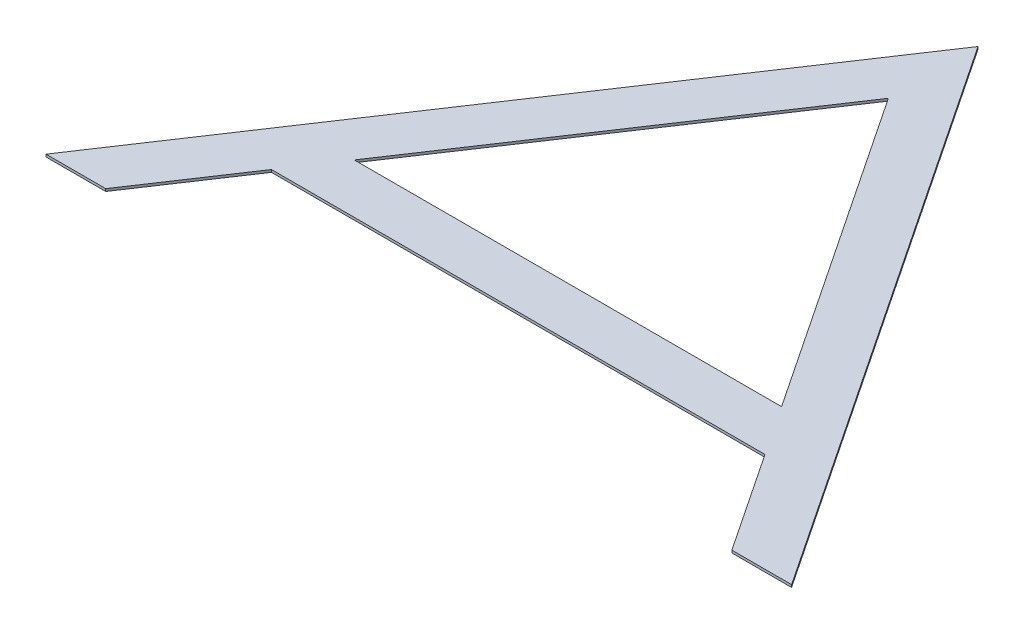
ISO-10303-21;
HEADER;
FILE_DESCRIPTION(('STEP AP214'),'2;1');
FILE_NAME('part.step','',(''),(''),'','','');
FILE_SCHEMA(('AUTOMOTIVE_DESIGN { 1 0 10303 214 1 1 1 1 }'));
ENDSEC;
DATA;
#1=APPLICATION_CONTEXT('core data for automotive mechanical design processes');
#2=APPLICATION_PROTOCOL_DEFINITION('international standard','automotive_design',2000,#1);
#3=PRODUCT_CONTEXT('',#1,'mechanical');
#4=PRODUCT('Part','Part','',(#3));
#5=PRODUCT_RELATED_PRODUCT_CATEGORY('part','',(#4));
#6=PRODUCT_DEFINITION_FORMATION('','',#4);
#7=PRODUCT_DEFINITION_CONTEXT('part definition',#1,'design');
#8=PRODUCT_DEFINITION('design','',#6,#7);
#9=PRODUCT_DEFINITION_SHAPE('','',#8);
#10=(LENGTH_UNIT() NAMED_UNIT(*) SI_UNIT(.MILLI.,.METRE.));
#11=(NAMED_UNIT(*) PLANE_ANGLE_UNIT() SI_UNIT($,.RADIAN.));
#12=(NAMED_UNIT(*) SI_UNIT($,.STERADIAN.) SOLID_ANGLE_UNIT());
#13=UNCERTAINTY_MEASURE_WITH_UNIT(LENGTH_MEASURE(1.E-05),#10,'distance_accuracy_value','');
#14=(GEOMETRIC_REPRESENTATION_CONTEXT(3) GLOBAL_UNCERTAINTY_ASSIGNED_CONTEXT((#13)) GLOBAL_UNIT_ASSIGNED_CONTEXT((#10,
#11,#12)) REPRESENTATION_CONTEXT('',''));
#15=CARTESIAN_POINT('',(0.,0.,0.));
#16=DIRECTION('',(0.,0.,1.));
#17=DIRECTION('',(1.,0.,0.));
#18=AXIS2_PLACEMENT_3D('',#15,#16,#17);
#19=CARTESIAN_POINT('',(0.,0.,0.));
#20=DIRECTION('',(0.,1.,0.));
#21=DIRECTION('',(0.,0.,1.));
#22=AXIS2_PLACEMENT_3D('',#19,#20,#21);
#23=PLANE('',#22);
#24=DIRECTION('',(0.554687188998878,0.,-0.832058965675224));
#25=VECTOR('',#24,1.);
#26=CARTESIAN_POINT('',(-221.506133163058,0.,-147.665753773256));
#27=LINE('',#26,#25);
#28=CARTESIAN_POINT('',(-319.946634678979,0.,0.));
#29=VERTEX_POINT('',#28);
#30=CARTESIAN_POINT('',(-252.215595501302,0.,-101.6));
#31=VERTEX_POINT('',#30);
#32=EDGE_CURVE('E131',#29,#31,#27,.T.);
#33=ORIENTED_EDGE('',*,*,#32,.F.);
#34=DIRECTION('',(-1.,0.,0.));
#35=VECTOR('',#34,1.);
#36=CARTESIAN_POINT('',(0.,0.,0.));
#37=LINE('',#36,#35);
#38=CARTESIAN_POINT('',(-381.,0.,0.));
#39=VERTEX_POINT('',#38);
#40=EDGE_CURVE('E134',#29,#39,#37,.T.);
#41=ORIENTED_EDGE('',*,*,#40,.T.);
#42=DIRECTION('',(0.554687188998878,0.,-0.832058965675224));
#43=VECTOR('',#42,1.);
#44=CARTESIAN_POINT('',(-263.774728619359,0.,-175.843862974399));
#45=LINE('',#44,#43);
#46=CARTESIAN_POINT('',(0.,0.,-571.519357594));
#47=VERTEX_POINT('',#46);
#48=EDGE_CURVE('E139',#39,#47,#45,.T.);
#49=ORIENTED_EDGE('',*,*,#48,.T.);
#50=DIRECTION('',(0.554687188998878,0.,0.832058965675224));
#51=VECTOR('',#50,1.);
#52=CARTESIAN_POINT('',(263.774728619359,0.,-175.843862974399));
#53=LINE('',#52,#51);
#54=CARTESIAN_POINT('',(381.,0.,0.));
#55=VERTEX_POINT('',#54);
#56=EDGE_CURVE('E144',#47,#55,#53,.T.);
#57=ORIENTED_EDGE('',*,*,#56,.T.);
#58=DIRECTION('',(-1.,0.,0.));
#59=VECTOR('',#58,1.);
#60=CARTESIAN_POINT('',(0.,0.,0.));
#61=LINE('',#60,#59);
#62=CARTESIAN_POINT('',(319.946634678979,0.,0.));
#63=VERTEX_POINT('',#62);
#64=EDGE_CURVE('E149',#55,#63,#61,.T.);
#65=ORIENTED_EDGE('',*,*,#64,.T.);
#66=DIRECTION('',(0.554687188998878,0.,0.832058965675224));
#67=VECTOR('',#66,1.);
#68=CARTESIAN_POINT('',(221.506133163058,0.,-147.665753773256));
#69=LINE('',#68,#67);
#70=CARTESIAN_POINT('',(252.215595501302,0.,-101.6));
#71=VERTEX_POINT('',#70);
#72=EDGE_CURVE('E157',#71,#63,#69,.T.);
#73=ORIENTED_EDGE('',*,*,#72,.F.);
#74=DIRECTION('',(-1.,0.,0.));
#75=VECTOR('',#74,1.);
#76=CARTESIAN_POINT('',(0.,0.,-101.6));
#77=LINE('',#76,#75);
#78=EDGE_CURVE('E159',#71,#31,#77,.T.);
#79=ORIENTED_EDGE('',*,*,#78,.T.);
#80=EDGE_LOOP('',(#33,#41,#49,#57,#65,#73,#79));
#81=FACE_BOUND('',#80,.T.);
#82=DIRECTION('',(0.554687188998878,0.,-0.832058965675224));
#83=VECTOR('',#82,1.);
#84=CARTESIAN_POINT('',(-221.506133163058,0.,-147.665753773256));
#85=LINE('',#84,#83);
#86=CARTESIAN_POINT('',(-218.350075912464,0.,-152.4));
#87=VERTEX_POINT('',#86);
#88=CARTESIAN_POINT('',(0.,0.,-479.936207653786));
#89=VERTEX_POINT('',#88);
#90=EDGE_CURVE('E94',#87,#89,#85,.T.);
#91=ORIENTED_EDGE('',*,*,#90,.F.);
#92=DIRECTION('',(1.,0.,0.));
#93=VECTOR('',#92,1.);
#94=CARTESIAN_POINT('',(0.,0.,-152.4));
#95=LINE('',#94,#93);
#96=CARTESIAN_POINT('',(218.350075912464,0.,-152.4));
#97=VERTEX_POINT('',#96);
#98=EDGE_CURVE('E96',#87,#97,#95,.T.);
#99=ORIENTED_EDGE('',*,*,#98,.T.);
#100=DIRECTION('',(0.554687188998878,0.,0.832058965675224));
#101=VECTOR('',#100,1.);
#102=CARTESIAN_POINT('',(221.506133163058,0.,-147.665753773256));
#103=LINE('',#102,#101);
#104=EDGE_CURVE('E20',#89,#97,#103,.T.);
#105=ORIENTED_EDGE('',*,*,#104,.F.);
#106=EDGE_LOOP('',(#91,#99,#105));
#107=FACE_BOUND('',#106,.T.);
#108=ADVANCED_FACE('F17',(#81,#107),#23,.F.);
#109=CARTESIAN_POINT('',(221.506133163058,2.54,-147.665753773256));
#110=DIRECTION('',(-0.832058965675224,0.,0.554687188998878));
#111=DIRECTION('',(0.554687188998878,0.,0.832058965675224));
#112=AXIS2_PLACEMENT_3D('',#109,#110,#111);
#113=PLANE('',#112);
#114=DIRECTION('',(0.554687188998878,0.,0.832058965675224));
#115=VECTOR('',#114,1.);
#116=CARTESIAN_POINT('',(0.,2.54,-479.936207653786));
#117=LINE('',#116,#115);
#118=CARTESIAN_POINT('',(0.,2.54,-479.936207653786));
#119=VERTEX_POINT('',#118);
#120=CARTESIAN_POINT('',(218.350075912464,2.54,-152.4));
#121=VERTEX_POINT('',#120);
#122=EDGE_CURVE('E104',#119,#121,#117,.T.);
#123=ORIENTED_EDGE('',*,*,#122,.F.);
#124=DIRECTION('',(0.,1.,0.));
#125=VECTOR('',#124,1.);
#126=CARTESIAN_POINT('',(0.,2.54,-479.936207653786));
#127=LINE('',#126,#125);
#128=EDGE_CURVE('E101',#89,#119,#127,.T.);
#129=ORIENTED_EDGE('',*,*,#128,.F.);
#130=ORIENTED_EDGE('',*,*,#104,.T.);
#131=DIRECTION('',(0.,1.,0.));
#132=VECTOR('',#131,1.);
#133=CARTESIAN_POINT('',(218.350075912464,2.54,-152.4));
#134=LINE('',#133,#132);
#135=EDGE_CURVE('E99',#97,#121,#134,.T.);
#136=ORIENTED_EDGE('',*,*,#135,.T.);
#137=EDGE_LOOP('',(#123,#129,#130,#136));
#138=FACE_BOUND('',#137,.T.);
#139=ADVANCED_FACE('F102',(#138),#113,.T.);
#140=CARTESIAN_POINT('',(0.,2.54,-152.4));
#141=DIRECTION('',(0.,0.,1.));
#142=DIRECTION('',(1.,0.,0.));
#143=AXIS2_PLACEMENT_3D('',#140,#141,#142);
#144=PLANE('',#143);
#145=DIRECTION('',(0.,1.,0.));
#146=VECTOR('',#145,1.);
#147=CARTESIAN_POINT('',(-218.350075912464,2.54,-152.4));
#148=LINE('',#147,#146);
#149=CARTESIAN_POINT('',(-218.350075912464,2.54,-152.4));
#150=VERTEX_POINT('',#149);
#151=EDGE_CURVE('E108',#150,#87,#148,.F.);
#152=ORIENTED_EDGE('',*,*,#151,.F.);
#153=DIRECTION('',(1.,0.,0.));
#154=VECTOR('',#153,1.);
#155=CARTESIAN_POINT('',(0.,2.54,-152.4));
#156=LINE('',#155,#154);
#157=EDGE_CURVE('E118',#121,#150,#156,.F.);
#158=ORIENTED_EDGE('',*,*,#157,.F.);
#159=ORIENTED_EDGE('',*,*,#135,.F.);
#160=ORIENTED_EDGE('',*,*,#98,.F.);
#161=EDGE_LOOP('',(#152,#158,#159,#160));
#162=FACE_BOUND('',#161,.T.);
#163=ADVANCED_FACE('F119',(#162),#144,.F.);
#164=CARTESIAN_POINT('',(-221.506133163058,2.54,-147.665753773256));
#165=DIRECTION('',(0.832058965675224,0.,0.554687188998878));
#166=DIRECTION('',(0.554687188998878,0.,-0.832058965675224));
#167=AXIS2_PLACEMENT_3D('',#164,#165,#166);
#168=PLANE('',#167);
#169=DIRECTION('',(0.554687188998878,0.,-0.832058965675224));
#170=VECTOR('',#169,1.);
#171=CARTESIAN_POINT('',(-218.350075912464,2.54,-152.4));
#172=LINE('',#171,#170);
#173=EDGE_CURVE('E121',#150,#119,#172,.T.);
#174=ORIENTED_EDGE('',*,*,#173,.F.);
#175=ORIENTED_EDGE('',*,*,#151,.T.);
#176=ORIENTED_EDGE('',*,*,#90,.T.);
#177=ORIENTED_EDGE('',*,*,#128,.T.);
#178=EDGE_LOOP('',(#174,#175,#176,#177));
#179=FACE_BOUND('',#178,.T.);
#180=ADVANCED_FACE('F111',(#179),#168,.T.);
#181=CARTESIAN_POINT('',(0.,2.54,-101.6));
#182=DIRECTION('',(0.,0.,-1.));
#183=DIRECTION('',(-1.,0.,0.));
#184=AXIS2_PLACEMENT_3D('',#181,#182,#183);
#185=PLANE('',#184);
#186=DIRECTION('',(0.,1.,0.));
#187=VECTOR('',#186,1.);
#188=CARTESIAN_POINT('',(252.215595501302,2.54,-101.6));
#189=LINE('',#188,#187);
#190=CARTESIAN_POINT('',(252.215595501302,2.54,-101.6));
#191=VERTEX_POINT('',#190);
#192=EDGE_CURVE('E154',#191,#71,#189,.F.);
#193=ORIENTED_EDGE('',*,*,#192,.F.);
#194=DIRECTION('',(1.,0.,0.));
#195=VECTOR('',#194,1.);
#196=CARTESIAN_POINT('',(0.,2.54,-101.6));
#197=LINE('',#196,#195);
#198=CARTESIAN_POINT('',(-252.215595501302,2.54,-101.6));
#199=VERTEX_POINT('',#198);
#200=EDGE_CURVE('E166',#199,#191,#197,.T.);
#201=ORIENTED_EDGE('',*,*,#200,.F.);
#202=DIRECTION('',(0.,1.,0.));
#203=VECTOR('',#202,1.);
#204=CARTESIAN_POINT('',(-252.215595501302,2.54,-101.6));
#205=LINE('',#204,#203);
#206=EDGE_CURVE('E125',#31,#199,#205,.T.);
#207=ORIENTED_EDGE('',*,*,#206,.F.);
#208=ORIENTED_EDGE('',*,*,#78,.F.);
#209=EDGE_LOOP('',(#193,#201,#207,#208));
#210=FACE_BOUND('',#209,.T.);
#211=ADVANCED_FACE('F164',(#210),#185,.F.);
#212=CARTESIAN_POINT('',(221.506133163058,2.54,-147.665753773256));
#213=DIRECTION('',(-0.832058965675224,0.,0.554687188998878));
#214=DIRECTION('',(0.554687188998878,0.,0.832058965675224));
#215=AXIS2_PLACEMENT_3D('',#212,#213,#214);
#216=PLANE('',#215);
#217=DIRECTION('',(0.554687188998877,0.,0.832058965675224));
#218=VECTOR('',#217,1.);
#219=CARTESIAN_POINT('',(252.215595501302,2.54,-101.6));
#220=LINE('',#219,#218);
#221=CARTESIAN_POINT('',(319.946634678979,2.54,0.));
#222=VERTEX_POINT('',#221);
#223=EDGE_CURVE('E184',#191,#222,#220,.T.);
#224=ORIENTED_EDGE('',*,*,#223,.F.);
#225=ORIENTED_EDGE('',*,*,#192,.T.);
#226=ORIENTED_EDGE('',*,*,#72,.T.);
#227=DIRECTION('',(0.,1.,0.));
#228=VECTOR('',#227,1.);
#229=CARTESIAN_POINT('',(319.946634678979,2.54,0.));
#230=LINE('',#229,#228);
#231=EDGE_CURVE('E152',#63,#222,#230,.T.);
#232=ORIENTED_EDGE('',*,*,#231,.T.);
#233=EDGE_LOOP('',(#224,#225,#226,#232));
#234=FACE_BOUND('',#233,.T.);
#235=ADVANCED_FACE('F190',(#234),#216,.T.);
#236=CARTESIAN_POINT('',(0.,2.54,0.));
#237=DIRECTION('',(0.,0.,-1.));
#238=DIRECTION('',(-1.,0.,0.));
#239=AXIS2_PLACEMENT_3D('',#236,#237,#238);
#240=PLANE('',#239);
#241=DIRECTION('',(0.,1.,0.));
#242=VECTOR('',#241,1.);
#243=CARTESIAN_POINT('',(381.,2.54,0.));
#244=LINE('',#243,#242);
#245=CARTESIAN_POINT('',(381.,2.54,0.));
#246=VERTEX_POINT('',#245);
#247=EDGE_CURVE('E147',#55,#246,#244,.T.);
#248=ORIENTED_EDGE('',*,*,#247,.T.);
#249=DIRECTION('',(1.,0.,0.));
#250=VECTOR('',#249,1.);
#251=CARTESIAN_POINT('',(0.,2.54,0.));
#252=LINE('',#251,#250);
#253=EDGE_CURVE('E181',#222,#246,#252,.T.);
#254=ORIENTED_EDGE('',*,*,#253,.F.);
#255=ORIENTED_EDGE('',*,*,#231,.F.);
#256=ORIENTED_EDGE('',*,*,#64,.F.);
#257=EDGE_LOOP('',(#248,#254,#255,#256));
#258=FACE_BOUND('',#257,.T.);
#259=ADVANCED_FACE('F193',(#258),#240,.F.);
#260=CARTESIAN_POINT('',(263.774728619359,2.54,-175.843862974399));
#261=DIRECTION('',(-0.832058965675224,0.,0.554687188998878));
#262=DIRECTION('',(0.554687188998878,0.,0.832058965675224));
#263=AXIS2_PLACEMENT_3D('',#260,#261,#262);
#264=PLANE('',#263);
#265=DIRECTION('',(0.,1.,0.));
#266=VECTOR('',#265,1.);
#267=CARTESIAN_POINT('',(0.,2.54,-571.519357594));
#268=LINE('',#267,#266);
#269=CARTESIAN_POINT('',(1.11556146976226E-13,2.54,-571.519357594));
#270=VERTEX_POINT('',#269);
#271=EDGE_CURVE('E142',#47,#270,#268,.T.);
#272=ORIENTED_EDGE('',*,*,#271,.T.);
#273=DIRECTION('',(-0.554687188998878,0.,-0.832058965675224));
#274=VECTOR('',#273,1.);
#275=CARTESIAN_POINT('',(381.,2.54,0.));
#276=LINE('',#275,#274);
#277=EDGE_CURVE('E177',#246,#270,#276,.T.);
#278=ORIENTED_EDGE('',*,*,#277,.F.);
#279=ORIENTED_EDGE('',*,*,#247,.F.);
#280=ORIENTED_EDGE('',*,*,#56,.F.);
#281=EDGE_LOOP('',(#272,#278,#279,#280));
#282=FACE_BOUND('',#281,.T.);
#283=ADVANCED_FACE('F197',(#282),#264,.F.);
#284=CARTESIAN_POINT('',(-263.774728619359,2.54,-175.843862974399));
#285=DIRECTION('',(0.832058965675224,0.,0.554687188998878));
#286=DIRECTION('',(0.554687188998878,0.,-0.832058965675224));
#287=AXIS2_PLACEMENT_3D('',#284,#285,#286);
#288=PLANE('',#287);
#289=DIRECTION('',(0.,1.,0.));
#290=VECTOR('',#289,1.);
#291=CARTESIAN_POINT('',(-381.,2.54,0.));
#292=LINE('',#291,#290);
#293=CARTESIAN_POINT('',(-381.,2.54,0.));
#294=VERTEX_POINT('',#293);
#295=EDGE_CURVE('E137',#39,#294,#292,.T.);
#296=ORIENTED_EDGE('',*,*,#295,.T.);
#297=DIRECTION('',(-0.554687188998878,0.,0.832058965675224));
#298=VECTOR('',#297,1.);
#299=CARTESIAN_POINT('',(1.11022302462516E-13,2.54,-571.519357594));
#300=LINE('',#299,#298);
#301=EDGE_CURVE('E174',#270,#294,#300,.T.);
#302=ORIENTED_EDGE('',*,*,#301,.F.);
#303=ORIENTED_EDGE('',*,*,#271,.F.);
#304=ORIENTED_EDGE('',*,*,#48,.F.);
#305=EDGE_LOOP('',(#296,#302,#303,#304));
#306=FACE_BOUND('',#305,.T.);
#307=ADVANCED_FACE('F200',(#306),#288,.F.);
#308=CARTESIAN_POINT('',(0.,2.54,0.));
#309=DIRECTION('',(0.,0.,-1.));
#310=DIRECTION('',(-1.,0.,0.));
#311=AXIS2_PLACEMENT_3D('',#308,#309,#310);
#312=PLANE('',#311);
#313=DIRECTION('',(0.,1.,0.));
#314=VECTOR('',#313,1.);
#315=CARTESIAN_POINT('',(-319.946634678979,2.54,0.));
#316=LINE('',#315,#314);
#317=CARTESIAN_POINT('',(-319.946634678979,2.54,0.));
#318=VERTEX_POINT('',#317);
#319=EDGE_CURVE('E35',#318,#29,#316,.F.);
#320=ORIENTED_EDGE('',*,*,#319,.F.);
#321=DIRECTION('',(1.,0.,0.));
#322=VECTOR('',#321,1.);
#323=CARTESIAN_POINT('',(0.,2.54,0.));
#324=LINE('',#323,#322);
#325=EDGE_CURVE('E26',#294,#318,#324,.T.);
#326=ORIENTED_EDGE('',*,*,#325,.F.);
#327=ORIENTED_EDGE('',*,*,#295,.F.);
#328=ORIENTED_EDGE('',*,*,#40,.F.);
#329=EDGE_LOOP('',(#320,#326,#327,#328));
#330=FACE_BOUND('',#329,.T.);
#331=ADVANCED_FACE('F201',(#330),#312,.F.);
#332=CARTESIAN_POINT('',(-221.506133163058,2.54,-147.665753773256));
#333=DIRECTION('',(0.832058965675224,0.,0.554687188998878));
#334=DIRECTION('',(0.554687188998878,0.,-0.832058965675224));
#335=AXIS2_PLACEMENT_3D('',#332,#333,#334);
#336=PLANE('',#335);
#337=DIRECTION('',(0.554687188998877,0.,-0.832058965675224));
#338=VECTOR('',#337,1.);
#339=CARTESIAN_POINT('',(-319.946634678979,2.54,0.));
#340=LINE('',#339,#338);
#341=EDGE_CURVE('E11',#318,#199,#340,.T.);
#342=ORIENTED_EDGE('',*,*,#341,.F.);
#343=ORIENTED_EDGE('',*,*,#319,.T.);
#344=ORIENTED_EDGE('',*,*,#32,.T.);
#345=ORIENTED_EDGE('',*,*,#206,.T.);
#346=EDGE_LOOP('',(#342,#343,#344,#345));
#347=FACE_BOUND('',#346,.T.);
#348=ADVANCED_FACE('F168',(#347),#336,.T.);
#349=CARTESIAN_POINT('',(0.,2.54,0.));
#350=DIRECTION('',(0.,1.,0.));
#351=DIRECTION('',(0.,0.,1.));
#352=AXIS2_PLACEMENT_3D('',#349,#350,#351);
#353=PLANE('',#352);
#354=ORIENTED_EDGE('',*,*,#325,.T.);
#355=ORIENTED_EDGE('',*,*,#341,.T.);
#356=ORIENTED_EDGE('',*,*,#200,.T.);
#357=ORIENTED_EDGE('',*,*,#223,.T.);
#358=ORIENTED_EDGE('',*,*,#253,.T.);
#359=ORIENTED_EDGE('',*,*,#277,.T.);
#360=ORIENTED_EDGE('',*,*,#301,.T.);
#361=EDGE_LOOP('',(#354,#355,#356,#357,#358,#359,#360));
#362=FACE_BOUND('',#361,.T.);
#363=ORIENTED_EDGE('',*,*,#157,.T.);
#364=ORIENTED_EDGE('',*,*,#173,.T.);
#365=ORIENTED_EDGE('',*,*,#122,.T.);
#366=EDGE_LOOP('',(#363,#364,#365));
#367=FACE_BOUND('',#366,.T.);
#368=ADVANCED_FACE('F123',(#362,#367),#353,.T.);
#369=CLOSED_SHELL('',(#108,#139,#163,#180,#211,#235,#259,#283,#307,#331,#348,#368));
#370=MANIFOLD_SOLID_BREP('B1',#369);
#371=ADVANCED_BREP_SHAPE_REPRESENTATION('',(#18,#370),#14);
#372=SHAPE_DEFINITION_REPRESENTATION(#9,#371);
ENDSEC;
END-ISO-10303-21;
